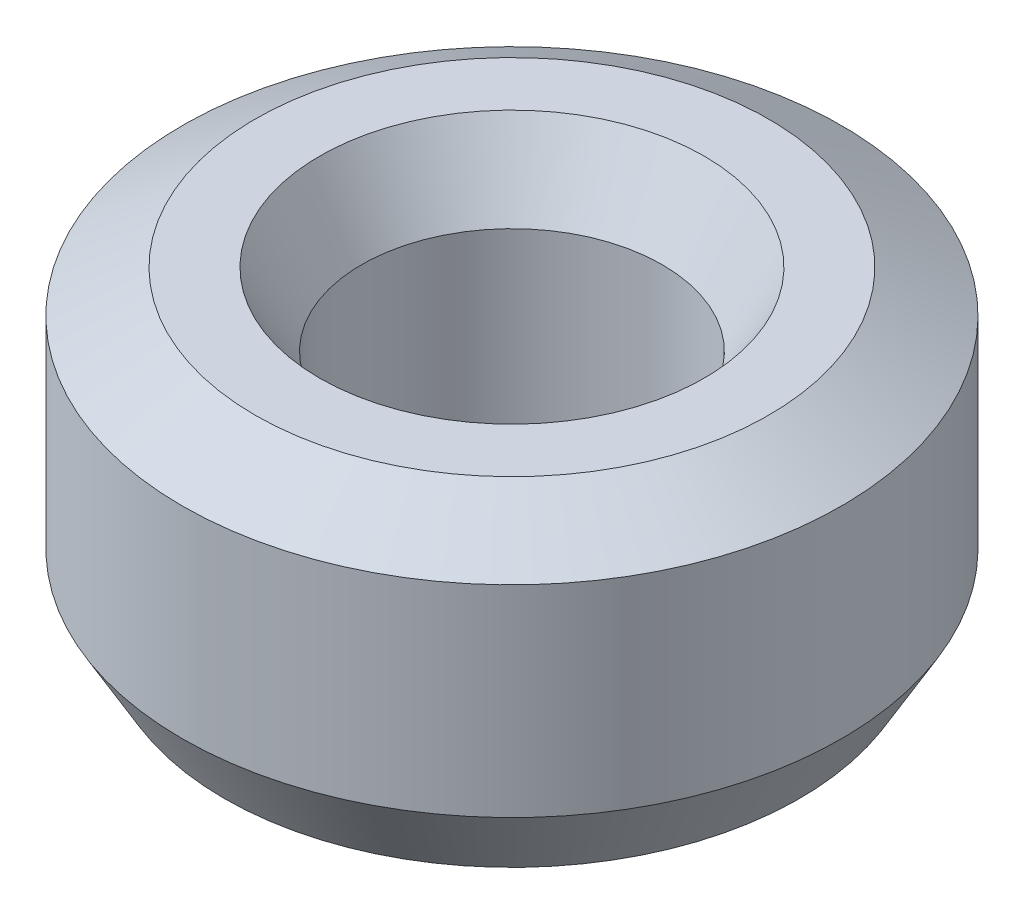
ISO-10303-21;
HEADER;
FILE_DESCRIPTION(('STEP AP214'),'2;1');
FILE_NAME('part.step','',(''),(''),'','','');
FILE_SCHEMA(('AUTOMOTIVE_DESIGN { 1 0 10303 214 1 1 1 1 }'));
ENDSEC;
DATA;
#1=APPLICATION_CONTEXT('core data for automotive mechanical design processes');
#2=APPLICATION_PROTOCOL_DEFINITION('international standard','automotive_design',2000,#1);
#3=PRODUCT_CONTEXT('',#1,'mechanical');
#4=PRODUCT('Part','Part','',(#3));
#5=PRODUCT_RELATED_PRODUCT_CATEGORY('part','',(#4));
#6=PRODUCT_DEFINITION_FORMATION('','',#4);
#7=PRODUCT_DEFINITION_CONTEXT('part definition',#1,'design');
#8=PRODUCT_DEFINITION('design','',#6,#7);
#9=PRODUCT_DEFINITION_SHAPE('','',#8);
#10=(LENGTH_UNIT() NAMED_UNIT(*) SI_UNIT(.MILLI.,.METRE.));
#11=(NAMED_UNIT(*) PLANE_ANGLE_UNIT() SI_UNIT($,.RADIAN.));
#12=(NAMED_UNIT(*) SI_UNIT($,.STERADIAN.) SOLID_ANGLE_UNIT());
#13=UNCERTAINTY_MEASURE_WITH_UNIT(LENGTH_MEASURE(1.E-05),#10,'distance_accuracy_value','');
#14=(GEOMETRIC_REPRESENTATION_CONTEXT(3) GLOBAL_UNCERTAINTY_ASSIGNED_CONTEXT((#13)) GLOBAL_UNIT_ASSIGNED_CONTEXT((#10,
#11,#12)) REPRESENTATION_CONTEXT('',''));
#15=CARTESIAN_POINT('',(0.,0.,0.));
#16=DIRECTION('',(0.,0.,1.));
#17=DIRECTION('',(1.,0.,0.));
#18=AXIS2_PLACEMENT_3D('',#15,#16,#17);
#19=CARTESIAN_POINT('',(0.,26.4166666449951,0.));
#20=DIRECTION('',(0.,-1.,0.));
#21=DIRECTION('',(0.,0.,-1.));
#22=AXIS2_PLACEMENT_3D('',#19,#20,#21);
#23=CYLINDRICAL_SURFACE('',#22,27.5);
#24=CARTESIAN_POINT('',(0.,6.08448389493499,0.));
#25=DIRECTION('',(0.,1.,0.));
#26=DIRECTION('',(0.,0.,1.));
#27=AXIS2_PLACEMENT_3D('',#24,#25,#26);
#28=CIRCLE('',#27,27.5);
#29=CARTESIAN_POINT('',(0.,6.08448389493499,27.5));
#30=VERTEX_POINT('',#29);
#31=EDGE_CURVE('E10',#30,#30,#28,.T.);
#32=ORIENTED_EDGE('',*,*,#31,.T.);
#33=EDGE_LOOP('',(#32));
#34=FACE_BOUND('',#33,.T.);
#35=CARTESIAN_POINT('',(0.,22.9037882303744,0.));
#36=DIRECTION('',(0.,1.,0.));
#37=DIRECTION('',(0.,0.,1.));
#38=AXIS2_PLACEMENT_3D('',#35,#36,#37);
#39=CIRCLE('',#38,27.5);
#40=CARTESIAN_POINT('',(0.,22.9037882303744,27.5));
#41=VERTEX_POINT('',#40);
#42=EDGE_CURVE('E50',#41,#41,#39,.F.);
#43=ORIENTED_EDGE('',*,*,#42,.T.);
#44=EDGE_LOOP('',(#43));
#45=FACE_BOUND('',#44,.T.);
#46=ADVANCED_FACE('F39',(#34,#45),#23,.T.);
#47=CARTESIAN_POINT('',(0.,26.4166666449951,0.));
#48=DIRECTION('',(0.,1.,0.));
#49=DIRECTION('',(0.,0.,1.));
#50=AXIS2_PLACEMENT_3D('',#47,#48,#49);
#51=PLANE('',#50);
#52=CARTESIAN_POINT('',(0.,26.4166666449951,0.));
#53=DIRECTION('',(0.,1.,0.));
#54=DIRECTION('',(0.,0.,1.));
#55=AXIS2_PLACEMENT_3D('',#52,#53,#54);
#56=CIRCLE('',#55,16.0498472891804);
#57=CARTESIAN_POINT('',(0.,26.4166666449951,16.0498472891804));
#58=VERTEX_POINT('',#57);
#59=EDGE_CURVE('E58',#58,#58,#56,.F.);
#60=ORIENTED_EDGE('',*,*,#59,.T.);
#61=EDGE_LOOP('',(#60));
#62=FACE_BOUND('',#61,.T.);
#63=CARTESIAN_POINT('',(0.,26.4166666449951,0.));
#64=DIRECTION('',(0.,1.,0.));
#65=DIRECTION('',(0.,0.,1.));
#66=AXIS2_PLACEMENT_3D('',#63,#64,#65);
#67=CIRCLE('',#66,21.415516105065);
#68=CARTESIAN_POINT('',(0.,26.4166666449951,21.415516105065));
#69=VERTEX_POINT('',#68);
#70=EDGE_CURVE('E61',#69,#69,#67,.T.);
#71=ORIENTED_EDGE('',*,*,#70,.T.);
#72=EDGE_LOOP('',(#71));
#73=FACE_BOUND('',#72,.T.);
#74=ADVANCED_FACE('F88',(#62,#73),#51,.T.);
#75=CARTESIAN_POINT('',(0.,0.,0.));
#76=DIRECTION('',(0.,1.,0.));
#77=DIRECTION('',(0.,0.,1.));
#78=AXIS2_PLACEMENT_3D('',#75,#76,#77);
#79=PLANE('',#78);
#80=CARTESIAN_POINT('',(0.,0.,0.));
#81=DIRECTION('',(0.,1.,0.));
#82=DIRECTION('',(0.,0.,1.));
#83=AXIS2_PLACEMENT_3D('',#80,#81,#82);
#84=CIRCLE('',#83,18.6214527694947);
#85=CARTESIAN_POINT('',(0.,0.,18.6214527694947));
#86=VERTEX_POINT('',#85);
#87=EDGE_CURVE('E51',#86,#86,#84,.T.);
#88=ORIENTED_EDGE('',*,*,#87,.T.);
#89=EDGE_LOOP('',(#88));
#90=FACE_BOUND('',#89,.T.);
#91=CARTESIAN_POINT('',(0.,0.,0.));
#92=DIRECTION('',(0.,1.,0.));
#93=DIRECTION('',(0.,0.,1.));
#94=AXIS2_PLACEMENT_3D('',#91,#92,#93);
#95=CIRCLE('',#94,23.9871215853793);
#96=CARTESIAN_POINT('',(0.,0.,23.9871215853793));
#97=VERTEX_POINT('',#96);
#98=EDGE_CURVE('E54',#97,#97,#95,.F.);
#99=ORIENTED_EDGE('',*,*,#98,.T.);
#100=EDGE_LOOP('',(#99));
#101=FACE_BOUND('',#100,.T.);
#102=ADVANCED_FACE('F83',(#90,#101),#79,.F.);
#103=CARTESIAN_POINT('',(0.,26.4166666449951,0.));
#104=DIRECTION('',(0.,-1.,0.));
#105=DIRECTION('',(0.,0.,-1.));
#106=AXIS2_PLACEMENT_3D('',#103,#104,#105);
#107=CYLINDRICAL_SURFACE('',#106,12.5369688745597);
#108=CARTESIAN_POINT('',(0.,20.3321827500601,0.));
#109=DIRECTION('',(0.,1.,0.));
#110=DIRECTION('',(0.,0.,1.));
#111=AXIS2_PLACEMENT_3D('',#108,#109,#110);
#112=CIRCLE('',#111,12.5369688745597);
#113=CARTESIAN_POINT('',(0.,20.3321827500601,12.5369688745597));
#114=VERTEX_POINT('',#113);
#115=EDGE_CURVE('E67',#114,#114,#112,.T.);
#116=ORIENTED_EDGE('',*,*,#115,.T.);
#117=EDGE_LOOP('',(#116));
#118=FACE_BOUND('',#117,.T.);
#119=CARTESIAN_POINT('',(0.,3.5128784146207,0.));
#120=DIRECTION('',(0.,1.,0.));
#121=DIRECTION('',(0.,0.,1.));
#122=AXIS2_PLACEMENT_3D('',#119,#120,#121);
#123=CIRCLE('',#122,12.5369688745597);
#124=CARTESIAN_POINT('',(0.,3.5128784146207,12.5369688745597));
#125=VERTEX_POINT('',#124);
#126=EDGE_CURVE('E69',#125,#125,#123,.F.);
#127=ORIENTED_EDGE('',*,*,#126,.T.);
#128=EDGE_LOOP('',(#127));
#129=FACE_BOUND('',#128,.T.);
#130=ADVANCED_FACE('F71',(#118,#129),#107,.F.);
#131=CARTESIAN_POINT('',(0.,20.3321827500601,0.));
#132=DIRECTION('',(0.,1.,0.));
#133=DIRECTION('',(0.,0.,1.));
#134=AXIS2_PLACEMENT_3D('',#131,#132,#133);
#135=CONICAL_SURFACE('',#134,12.5369688745597,0.523598775598303);
#136=ORIENTED_EDGE('',*,*,#59,.F.);
#137=EDGE_LOOP('',(#136));
#138=FACE_BOUND('',#137,.T.);
#139=ORIENTED_EDGE('',*,*,#115,.F.);
#140=EDGE_LOOP('',(#139));
#141=FACE_BOUND('',#140,.T.);
#142=ADVANCED_FACE('F77',(#138,#141),#135,.F.);
#143=CARTESIAN_POINT('',(0.,0.,0.));
#144=DIRECTION('',(0.,-1.,0.));
#145=DIRECTION('',(0.,0.,-1.));
#146=AXIS2_PLACEMENT_3D('',#143,#144,#145);
#147=CONICAL_SURFACE('',#146,18.6214527694947,1.04719755119659);
#148=ORIENTED_EDGE('',*,*,#126,.F.);
#149=EDGE_LOOP('',(#148));
#150=FACE_BOUND('',#149,.T.);
#151=ORIENTED_EDGE('',*,*,#87,.F.);
#152=EDGE_LOOP('',(#151));
#153=FACE_BOUND('',#152,.T.);
#154=ADVANCED_FACE('F73',(#150,#153),#147,.F.);
#155=CARTESIAN_POINT('',(0.,6.08448389493499,0.));
#156=DIRECTION('',(0.,1.,0.));
#157=DIRECTION('',(0.,0.,1.));
#158=AXIS2_PLACEMENT_3D('',#155,#156,#157);
#159=CONICAL_SURFACE('',#158,27.5,0.523598775598302);
#160=ORIENTED_EDGE('',*,*,#98,.F.);
#161=EDGE_LOOP('',(#160));
#162=FACE_BOUND('',#161,.T.);
#163=ORIENTED_EDGE('',*,*,#31,.F.);
#164=EDGE_LOOP('',(#163));
#165=FACE_BOUND('',#164,.T.);
#166=ADVANCED_FACE('F76',(#162,#165),#159,.T.);
#167=CARTESIAN_POINT('',(0.,26.4166666449951,0.));
#168=DIRECTION('',(0.,-1.,0.));
#169=DIRECTION('',(0.,0.,-1.));
#170=AXIS2_PLACEMENT_3D('',#167,#168,#169);
#171=CONICAL_SURFACE('',#170,21.415516105065,1.04719755119659);
#172=ORIENTED_EDGE('',*,*,#42,.F.);
#173=EDGE_LOOP('',(#172));
#174=FACE_BOUND('',#173,.T.);
#175=ORIENTED_EDGE('',*,*,#70,.F.);
#176=EDGE_LOOP('',(#175));
#177=FACE_BOUND('',#176,.T.);
#178=ADVANCED_FACE('F45',(#174,#177),#171,.T.);
#179=CLOSED_SHELL('',(#46,#74,#102,#130,#142,#154,#166,#178));
#180=MANIFOLD_SOLID_BREP('B2',#179);
#181=ADVANCED_BREP_SHAPE_REPRESENTATION('',(#18,#180),#14);
#182=SHAPE_DEFINITION_REPRESENTATION(#9,#181);
ENDSEC;
END-ISO-10303-21;
